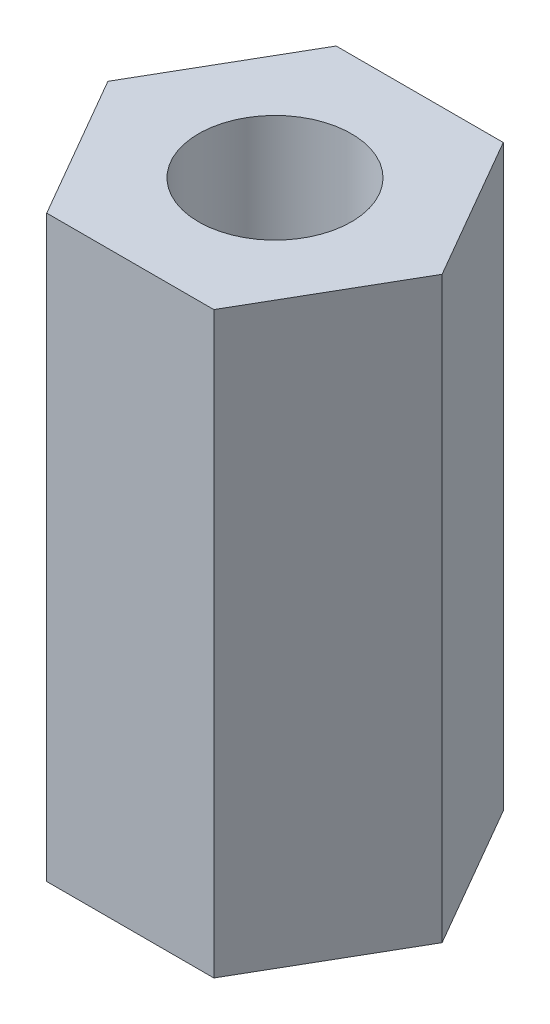
ISO-10303-21;
HEADER;
FILE_DESCRIPTION(('STEP AP214'),'2;1');
FILE_NAME('part.step','',(''),(''),'','','');
FILE_SCHEMA(('AUTOMOTIVE_DESIGN { 1 0 10303 214 1 1 1 1 }'));
ENDSEC;
DATA;
#1=APPLICATION_CONTEXT('core data for automotive mechanical design processes');
#2=APPLICATION_PROTOCOL_DEFINITION('international standard','automotive_design',2000,#1);
#3=PRODUCT_CONTEXT('',#1,'mechanical');
#4=PRODUCT('Part','Part','',(#3));
#5=PRODUCT_RELATED_PRODUCT_CATEGORY('part','',(#4));
#6=PRODUCT_DEFINITION_FORMATION('','',#4);
#7=PRODUCT_DEFINITION_CONTEXT('part definition',#1,'design');
#8=PRODUCT_DEFINITION('design','',#6,#7);
#9=PRODUCT_DEFINITION_SHAPE('','',#8);
#10=(LENGTH_UNIT() NAMED_UNIT(*) SI_UNIT(.MILLI.,.METRE.));
#11=(NAMED_UNIT(*) PLANE_ANGLE_UNIT() SI_UNIT($,.RADIAN.));
#12=(NAMED_UNIT(*) SI_UNIT($,.STERADIAN.) SOLID_ANGLE_UNIT());
#13=UNCERTAINTY_MEASURE_WITH_UNIT(LENGTH_MEASURE(1.E-05),#10,'distance_accuracy_value','');
#14=(GEOMETRIC_REPRESENTATION_CONTEXT(3) GLOBAL_UNCERTAINTY_ASSIGNED_CONTEXT((#13)) GLOBAL_UNIT_ASSIGNED_CONTEXT((#10,
#11,#12)) REPRESENTATION_CONTEXT('',''));
#15=CARTESIAN_POINT('',(0.,0.,0.));
#16=DIRECTION('',(0.,0.,1.));
#17=DIRECTION('',(1.,0.,0.));
#18=AXIS2_PLACEMENT_3D('',#15,#16,#17);
#19=CARTESIAN_POINT('',(7.33234841870824,25.4,0.));
#20=DIRECTION('',(0.,1.,0.));
#21=DIRECTION('',(0.,0.,1.));
#22=AXIS2_PLACEMENT_3D('',#19,#20,#21);
#23=PLANE('',#22);
#24=DIRECTION('',(0.499999999999999,0.,-0.866025403784439));
#25=VECTOR('',#24,1.);
#26=CARTESIAN_POINT('',(3.66617420935413,25.4,6.35000000000001));
#27=LINE('',#26,#25);
#28=CARTESIAN_POINT('',(3.66617420935413,25.4,6.35000000000001));
#29=VERTEX_POINT('',#28);
#30=CARTESIAN_POINT('',(7.33234841870824,25.4,0.));
#31=VERTEX_POINT('',#30);
#32=EDGE_CURVE('E129',#29,#31,#27,.T.);
#33=ORIENTED_EDGE('',*,*,#32,.T.);
#34=DIRECTION('',(-0.5,0.,-0.866025403784439));
#35=VECTOR('',#34,1.);
#36=CARTESIAN_POINT('',(7.33234841870824,25.4,0.));
#37=LINE('',#36,#35);
#38=CARTESIAN_POINT('',(3.66617420935411,25.4,-6.35));
#39=VERTEX_POINT('',#38);
#40=EDGE_CURVE('E87',#31,#39,#37,.T.);
#41=ORIENTED_EDGE('',*,*,#40,.T.);
#42=DIRECTION('',(-1.,0.,0.));
#43=VECTOR('',#42,1.);
#44=CARTESIAN_POINT('',(3.66617420935411,25.4,-6.35));
#45=LINE('',#44,#43);
#46=CARTESIAN_POINT('',(-3.66617420935411,25.4,-6.35));
#47=VERTEX_POINT('',#46);
#48=EDGE_CURVE('E100',#39,#47,#45,.T.);
#49=ORIENTED_EDGE('',*,*,#48,.T.);
#50=DIRECTION('',(-0.499999999999999,0.,0.866025403784439));
#51=VECTOR('',#50,1.);
#52=CARTESIAN_POINT('',(-3.66617420935411,25.4,-6.35));
#53=LINE('',#52,#51);
#54=CARTESIAN_POINT('',(-7.33234841870824,25.4,0.));
#55=VERTEX_POINT('',#54);
#56=EDGE_CURVE('E94',#47,#55,#53,.T.);
#57=ORIENTED_EDGE('',*,*,#56,.T.);
#58=DIRECTION('',(0.5,0.,0.866025403784439));
#59=VECTOR('',#58,1.);
#60=CARTESIAN_POINT('',(-7.33234841870824,25.4,0.));
#61=LINE('',#60,#59);
#62=CARTESIAN_POINT('',(-3.66617420935412,25.4,6.35000000000002));
#63=VERTEX_POINT('',#62);
#64=EDGE_CURVE('E98',#55,#63,#61,.T.);
#65=ORIENTED_EDGE('',*,*,#64,.T.);
#66=DIRECTION('',(1.,0.,0.));
#67=VECTOR('',#66,1.);
#68=CARTESIAN_POINT('',(-3.66617420935412,25.4,6.35000000000002));
#69=LINE('',#68,#67);
#70=EDGE_CURVE('E50',#63,#29,#69,.T.);
#71=ORIENTED_EDGE('',*,*,#70,.T.);
#72=EDGE_LOOP('',(#33,#41,#49,#57,#65,#71));
#73=FACE_BOUND('',#72,.T.);
#74=CARTESIAN_POINT('',(0.,25.4,0.));
#75=DIRECTION('',(0.,1.,0.));
#76=DIRECTION('',(0.,0.,1.));
#77=AXIS2_PLACEMENT_3D('',#74,#75,#76);
#78=CIRCLE('',#77,3.3528);
#79=CARTESIAN_POINT('',(0.,25.4,3.3528));
#80=VERTEX_POINT('',#79);
#81=EDGE_CURVE('E122',#80,#80,#78,.T.);
#82=ORIENTED_EDGE('',*,*,#81,.F.);
#83=EDGE_LOOP('',(#82));
#84=FACE_BOUND('',#83,.T.);
#85=ADVANCED_FACE('F33',(#73,#84),#23,.T.);
#86=CARTESIAN_POINT('',(7.33234841870824,0.,0.));
#87=DIRECTION('',(0.,1.,0.));
#88=DIRECTION('',(0.,0.,1.));
#89=AXIS2_PLACEMENT_3D('',#86,#87,#88);
#90=PLANE('',#89);
#91=DIRECTION('',(0.499999999999999,0.,-0.866025403784439));
#92=VECTOR('',#91,1.);
#93=CARTESIAN_POINT('',(3.66617420935413,0.,6.35000000000001));
#94=LINE('',#93,#92);
#95=CARTESIAN_POINT('',(3.66617420935413,0.,6.35000000000001));
#96=VERTEX_POINT('',#95);
#97=CARTESIAN_POINT('',(7.33234841870824,0.,0.));
#98=VERTEX_POINT('',#97);
#99=EDGE_CURVE('E118',#96,#98,#94,.T.);
#100=ORIENTED_EDGE('',*,*,#99,.F.);
#101=DIRECTION('',(1.,0.,0.));
#102=VECTOR('',#101,1.);
#103=CARTESIAN_POINT('',(-3.66617420935412,0.,6.35000000000002));
#104=LINE('',#103,#102);
#105=CARTESIAN_POINT('',(-3.66617420935412,0.,6.35000000000002));
#106=VERTEX_POINT('',#105);
#107=EDGE_CURVE('E79',#106,#96,#104,.T.);
#108=ORIENTED_EDGE('',*,*,#107,.F.);
#109=DIRECTION('',(0.5,0.,0.866025403784439));
#110=VECTOR('',#109,1.);
#111=CARTESIAN_POINT('',(-7.33234841870824,0.,0.));
#112=LINE('',#111,#110);
#113=CARTESIAN_POINT('',(-7.33234841870824,0.,0.));
#114=VERTEX_POINT('',#113);
#115=EDGE_CURVE('E73',#114,#106,#112,.T.);
#116=ORIENTED_EDGE('',*,*,#115,.F.);
#117=DIRECTION('',(-0.499999999999999,0.,0.866025403784439));
#118=VECTOR('',#117,1.);
#119=CARTESIAN_POINT('',(-3.66617420935411,0.,-6.35));
#120=LINE('',#119,#118);
#121=CARTESIAN_POINT('',(-3.66617420935411,0.,-6.35));
#122=VERTEX_POINT('',#121);
#123=EDGE_CURVE('E108',#122,#114,#120,.T.);
#124=ORIENTED_EDGE('',*,*,#123,.F.);
#125=DIRECTION('',(-1.,0.,0.));
#126=VECTOR('',#125,1.);
#127=CARTESIAN_POINT('',(3.66617420935411,0.,-6.35));
#128=LINE('',#127,#126);
#129=CARTESIAN_POINT('',(3.66617420935411,0.,-6.35));
#130=VERTEX_POINT('',#129);
#131=EDGE_CURVE('E124',#130,#122,#128,.T.);
#132=ORIENTED_EDGE('',*,*,#131,.F.);
#133=DIRECTION('',(-0.5,0.,-0.866025403784439));
#134=VECTOR('',#133,1.);
#135=CARTESIAN_POINT('',(7.33234841870824,0.,0.));
#136=LINE('',#135,#134);
#137=EDGE_CURVE('E121',#98,#130,#136,.T.);
#138=ORIENTED_EDGE('',*,*,#137,.F.);
#139=EDGE_LOOP('',(#100,#108,#116,#124,#132,#138));
#140=FACE_BOUND('',#139,.T.);
#141=CARTESIAN_POINT('',(0.,0.,0.));
#142=DIRECTION('',(0.,1.,0.));
#143=DIRECTION('',(0.,0.,1.));
#144=AXIS2_PLACEMENT_3D('',#141,#142,#143);
#145=CIRCLE('',#144,3.3528);
#146=CARTESIAN_POINT('',(0.,0.,3.3528));
#147=VERTEX_POINT('',#146);
#148=EDGE_CURVE('E222',#147,#147,#145,.T.);
#149=ORIENTED_EDGE('',*,*,#148,.T.);
#150=EDGE_LOOP('',(#149));
#151=FACE_BOUND('',#150,.T.);
#152=ADVANCED_FACE('F138',(#140,#151),#90,.F.);
#153=CARTESIAN_POINT('',(3.66617420935413,25.4,6.35000000000001));
#154=DIRECTION('',(-0.866025403784439,0.,-0.499999999999999));
#155=DIRECTION('',(-0.499999999999999,0.,0.866025403784439));
#156=AXIS2_PLACEMENT_3D('',#153,#154,#155);
#157=PLANE('',#156);
#158=ORIENTED_EDGE('',*,*,#99,.T.);
#159=DIRECTION('',(0.,-1.,0.));
#160=VECTOR('',#159,1.);
#161=CARTESIAN_POINT('',(7.33234841870824,25.4,0.));
#162=LINE('',#161,#160);
#163=EDGE_CURVE('E11',#31,#98,#162,.T.);
#164=ORIENTED_EDGE('',*,*,#163,.F.);
#165=ORIENTED_EDGE('',*,*,#32,.F.);
#166=DIRECTION('',(0.,-1.,0.));
#167=VECTOR('',#166,1.);
#168=CARTESIAN_POINT('',(3.66617420935413,25.4,6.35000000000001));
#169=LINE('',#168,#167);
#170=EDGE_CURVE('E114',#29,#96,#169,.T.);
#171=ORIENTED_EDGE('',*,*,#170,.T.);
#172=EDGE_LOOP('',(#158,#164,#165,#171));
#173=FACE_BOUND('',#172,.T.);
#174=ADVANCED_FACE('F35',(#173),#157,.F.);
#175=CARTESIAN_POINT('',(7.33234841870824,25.4,0.));
#176=DIRECTION('',(-0.866025403784439,0.,0.5));
#177=DIRECTION('',(0.5,0.,0.866025403784439));
#178=AXIS2_PLACEMENT_3D('',#175,#176,#177);
#179=PLANE('',#178);
#180=ORIENTED_EDGE('',*,*,#137,.T.);
#181=DIRECTION('',(0.,-1.,0.));
#182=VECTOR('',#181,1.);
#183=CARTESIAN_POINT('',(3.66617420935411,25.4,-6.35));
#184=LINE('',#183,#182);
#185=EDGE_CURVE('E42',#39,#130,#184,.T.);
#186=ORIENTED_EDGE('',*,*,#185,.F.);
#187=ORIENTED_EDGE('',*,*,#40,.F.);
#188=ORIENTED_EDGE('',*,*,#163,.T.);
#189=EDGE_LOOP('',(#180,#186,#187,#188));
#190=FACE_BOUND('',#189,.T.);
#191=ADVANCED_FACE('F163',(#190),#179,.F.);
#192=CARTESIAN_POINT('',(3.66617420935411,25.4,-6.35));
#193=DIRECTION('',(0.,0.,1.));
#194=DIRECTION('',(1.,0.,0.));
#195=AXIS2_PLACEMENT_3D('',#192,#193,#194);
#196=PLANE('',#195);
#197=ORIENTED_EDGE('',*,*,#131,.T.);
#198=DIRECTION('',(0.,-1.,0.));
#199=VECTOR('',#198,1.);
#200=CARTESIAN_POINT('',(-3.66617420935411,25.4,-6.35));
#201=LINE('',#200,#199);
#202=EDGE_CURVE('E109',#47,#122,#201,.T.);
#203=ORIENTED_EDGE('',*,*,#202,.F.);
#204=ORIENTED_EDGE('',*,*,#48,.F.);
#205=ORIENTED_EDGE('',*,*,#185,.T.);
#206=EDGE_LOOP('',(#197,#203,#204,#205));
#207=FACE_BOUND('',#206,.T.);
#208=ADVANCED_FACE('F135',(#207),#196,.F.);
#209=CARTESIAN_POINT('',(-3.66617420935411,25.4,-6.35));
#210=DIRECTION('',(0.866025403784439,0.,0.499999999999999));
#211=DIRECTION('',(0.499999999999999,0.,-0.866025403784439));
#212=AXIS2_PLACEMENT_3D('',#209,#210,#211);
#213=PLANE('',#212);
#214=ORIENTED_EDGE('',*,*,#123,.T.);
#215=DIRECTION('',(0.,-1.,0.));
#216=VECTOR('',#215,1.);
#217=CARTESIAN_POINT('',(-7.33234841870824,25.4,0.));
#218=LINE('',#217,#216);
#219=EDGE_CURVE('E105',#55,#114,#218,.T.);
#220=ORIENTED_EDGE('',*,*,#219,.F.);
#221=ORIENTED_EDGE('',*,*,#56,.F.);
#222=ORIENTED_EDGE('',*,*,#202,.T.);
#223=EDGE_LOOP('',(#214,#220,#221,#222));
#224=FACE_BOUND('',#223,.T.);
#225=ADVANCED_FACE('F106',(#224),#213,.F.);
#226=CARTESIAN_POINT('',(-7.33234841870824,25.4,0.));
#227=DIRECTION('',(0.866025403784438,0.,-0.5));
#228=DIRECTION('',(-0.5,0.,-0.866025403784439));
#229=AXIS2_PLACEMENT_3D('',#226,#227,#228);
#230=PLANE('',#229);
#231=ORIENTED_EDGE('',*,*,#115,.T.);
#232=DIRECTION('',(0.,-1.,0.));
#233=VECTOR('',#232,1.);
#234=CARTESIAN_POINT('',(-3.66617420935412,25.4,6.35000000000002));
#235=LINE('',#234,#233);
#236=EDGE_CURVE('E110',#63,#106,#235,.T.);
#237=ORIENTED_EDGE('',*,*,#236,.F.);
#238=ORIENTED_EDGE('',*,*,#64,.F.);
#239=ORIENTED_EDGE('',*,*,#219,.T.);
#240=EDGE_LOOP('',(#231,#237,#238,#239));
#241=FACE_BOUND('',#240,.T.);
#242=ADVANCED_FACE('F112',(#241),#230,.F.);
#243=CARTESIAN_POINT('',(-3.66617420935412,25.4,6.35000000000002));
#244=DIRECTION('',(0.,0.,-1.));
#245=DIRECTION('',(-1.,0.,0.));
#246=AXIS2_PLACEMENT_3D('',#243,#244,#245);
#247=PLANE('',#246);
#248=ORIENTED_EDGE('',*,*,#107,.T.);
#249=ORIENTED_EDGE('',*,*,#170,.F.);
#250=ORIENTED_EDGE('',*,*,#70,.F.);
#251=ORIENTED_EDGE('',*,*,#236,.T.);
#252=EDGE_LOOP('',(#248,#249,#250,#251));
#253=FACE_BOUND('',#252,.T.);
#254=ADVANCED_FACE('F143',(#253),#247,.F.);
#255=CARTESIAN_POINT('',(0.,25.4,0.));
#256=DIRECTION('',(0.,-1.,0.));
#257=DIRECTION('',(0.,0.,-1.));
#258=AXIS2_PLACEMENT_3D('',#255,#256,#257);
#259=CYLINDRICAL_SURFACE('',#258,3.3528);
#260=ORIENTED_EDGE('',*,*,#81,.T.);
#261=EDGE_LOOP('',(#260));
#262=FACE_BOUND('',#261,.T.);
#263=ORIENTED_EDGE('',*,*,#148,.F.);
#264=EDGE_LOOP('',(#263));
#265=FACE_BOUND('',#264,.T.);
#266=ADVANCED_FACE('F145',(#262,#265),#259,.F.);
#267=CLOSED_SHELL('',(#85,#152,#174,#191,#208,#225,#242,#254,#266));
#268=MANIFOLD_SOLID_BREP('B2',#267);
#269=ADVANCED_BREP_SHAPE_REPRESENTATION('',(#18,#268),#14);
#270=SHAPE_DEFINITION_REPRESENTATION(#9,#269);
ENDSEC;
END-ISO-10303-21;
